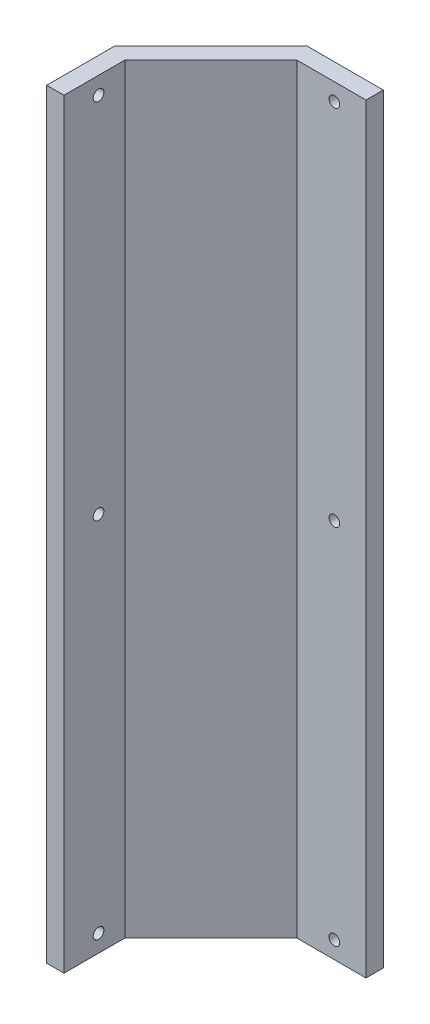
ISO-10303-21;
HEADER;
FILE_DESCRIPTION(('STEP AP214'),'2;1');
FILE_NAME('part.step','',(''),(''),'','','');
FILE_SCHEMA(('AUTOMOTIVE_DESIGN { 1 0 10303 214 1 1 1 1 }'));
ENDSEC;
DATA;
#1=APPLICATION_CONTEXT('core data for automotive mechanical design processes');
#2=APPLICATION_PROTOCOL_DEFINITION('international standard','automotive_design',2000,#1);
#3=PRODUCT_CONTEXT('',#1,'mechanical');
#4=PRODUCT('Part','Part','',(#3));
#5=PRODUCT_RELATED_PRODUCT_CATEGORY('part','',(#4));
#6=PRODUCT_DEFINITION_FORMATION('','',#4);
#7=PRODUCT_DEFINITION_CONTEXT('part definition',#1,'design');
#8=PRODUCT_DEFINITION('design','',#6,#7);
#9=PRODUCT_DEFINITION_SHAPE('','',#8);
#10=(LENGTH_UNIT() NAMED_UNIT(*) SI_UNIT(.MILLI.,.METRE.));
#11=(NAMED_UNIT(*) PLANE_ANGLE_UNIT() SI_UNIT($,.RADIAN.));
#12=(NAMED_UNIT(*) SI_UNIT($,.STERADIAN.) SOLID_ANGLE_UNIT());
#13=UNCERTAINTY_MEASURE_WITH_UNIT(LENGTH_MEASURE(1.E-05),#10,'distance_accuracy_value','');
#14=(GEOMETRIC_REPRESENTATION_CONTEXT(3) GLOBAL_UNCERTAINTY_ASSIGNED_CONTEXT((#13)) GLOBAL_UNIT_ASSIGNED_CONTEXT((#10,
#11,#12)) REPRESENTATION_CONTEXT('',''));
#15=CARTESIAN_POINT('',(0.,0.,0.));
#16=DIRECTION('',(0.,0.,1.));
#17=DIRECTION('',(1.,0.,0.));
#18=AXIS2_PLACEMENT_3D('',#15,#16,#17);
#19=CARTESIAN_POINT('',(-67.5233267740288,220.,-42.5));
#20=DIRECTION('',(0.,0.,-1.));
#21=DIRECTION('',(-1.,0.,0.));
#22=AXIS2_PLACEMENT_3D('',#19,#20,#21);
#23=PLANE('',#22);
#24=CARTESIAN_POINT('',(-76.6933267740289,5.,-42.5));
#25=DIRECTION('',(0.,0.,-1.));
#26=DIRECTION('',(-1.,0.,0.));
#27=AXIS2_PLACEMENT_3D('',#24,#25,#26);
#28=CIRCLE('',#27,1.54999999999999);
#29=CARTESIAN_POINT('',(-78.2433267740289,5.,-42.5));
#30=VERTEX_POINT('',#29);
#31=EDGE_CURVE('E215',#30,#30,#28,.F.);
#32=ORIENTED_EDGE('',*,*,#31,.F.);
#33=EDGE_LOOP('',(#32));
#34=FACE_BOUND('',#33,.T.);
#35=DIRECTION('',(1.,0.,0.));
#36=VECTOR('',#35,1.);
#37=CARTESIAN_POINT('',(-67.5233267740288,0.,-42.5));
#38=LINE('',#37,#36);
#39=CARTESIAN_POINT('',(-87.5233267740289,0.,-42.5));
#40=VERTEX_POINT('',#39);
#41=CARTESIAN_POINT('',(-67.5233267740288,0.,-42.5));
#42=VERTEX_POINT('',#41);
#43=EDGE_CURVE('E143',#40,#42,#38,.T.);
#44=ORIENTED_EDGE('',*,*,#43,.T.);
#45=DIRECTION('',(0.,-1.,0.));
#46=VECTOR('',#45,1.);
#47=CARTESIAN_POINT('',(-67.5233267740288,220.,-42.5));
#48=LINE('',#47,#46);
#49=CARTESIAN_POINT('',(-67.5233267740288,220.,-42.5));
#50=VERTEX_POINT('',#49);
#51=EDGE_CURVE('E11',#50,#42,#48,.T.);
#52=ORIENTED_EDGE('',*,*,#51,.F.);
#53=DIRECTION('',(1.,0.,0.));
#54=VECTOR('',#53,1.);
#55=CARTESIAN_POINT('',(-67.5233267740288,220.,-42.5));
#56=LINE('',#55,#54);
#57=CARTESIAN_POINT('',(-87.5233267740289,220.,-42.5));
#58=VERTEX_POINT('',#57);
#59=EDGE_CURVE('E166',#58,#50,#56,.T.);
#60=ORIENTED_EDGE('',*,*,#59,.F.);
#61=DIRECTION('',(0.,-1.,0.));
#62=VECTOR('',#61,1.);
#63=CARTESIAN_POINT('',(-87.5233267740289,220.,-42.5));
#64=LINE('',#63,#62);
#65=EDGE_CURVE('E139',#58,#40,#64,.T.);
#66=ORIENTED_EDGE('',*,*,#65,.T.);
#67=EDGE_LOOP('',(#44,#52,#60,#66));
#68=FACE_BOUND('',#67,.T.);
#69=CARTESIAN_POINT('',(-76.6933267740289,110.,-42.5));
#70=DIRECTION('',(0.,0.,-1.));
#71=DIRECTION('',(-1.,0.,0.));
#72=AXIS2_PLACEMENT_3D('',#69,#70,#71);
#73=CIRCLE('',#72,1.54999999999999);
#74=CARTESIAN_POINT('',(-78.2433267740289,110.,-42.5));
#75=VERTEX_POINT('',#74);
#76=EDGE_CURVE('E199',#75,#75,#73,.F.);
#77=ORIENTED_EDGE('',*,*,#76,.F.);
#78=EDGE_LOOP('',(#77));
#79=FACE_BOUND('',#78,.T.);
#80=CARTESIAN_POINT('',(-76.6933267740289,215.,-42.5));
#81=DIRECTION('',(0.,0.,-1.));
#82=DIRECTION('',(-1.,0.,0.));
#83=AXIS2_PLACEMENT_3D('',#80,#81,#82);
#84=CIRCLE('',#83,1.54999999999999);
#85=CARTESIAN_POINT('',(-78.2433267740289,215.,-42.5));
#86=VERTEX_POINT('',#85);
#87=EDGE_CURVE('E203',#86,#86,#84,.T.);
#88=ORIENTED_EDGE('',*,*,#87,.T.);
#89=EDGE_LOOP('',(#88));
#90=FACE_BOUND('',#89,.T.);
#91=ADVANCED_FACE('F39',(#34,#68,#79,#90),#23,.F.);
#92=CARTESIAN_POINT('',(-67.5233267740289,220.,-47.5));
#93=DIRECTION('',(0.,0.,1.));
#94=DIRECTION('',(1.,0.,0.));
#95=AXIS2_PLACEMENT_3D('',#92,#93,#94);
#96=PLANE('',#95);
#97=CARTESIAN_POINT('',(-76.6933267740289,5.,-47.5));
#98=DIRECTION('',(0.,0.,1.));
#99=DIRECTION('',(1.,0.,0.));
#100=AXIS2_PLACEMENT_3D('',#97,#98,#99);
#101=CIRCLE('',#100,1.54999999999999);
#102=CARTESIAN_POINT('',(-75.1433267740289,5.,-47.5));
#103=VERTEX_POINT('',#102);
#104=EDGE_CURVE('E42',#103,#103,#101,.F.);
#105=ORIENTED_EDGE('',*,*,#104,.F.);
#106=EDGE_LOOP('',(#105));
#107=FACE_BOUND('',#106,.T.);
#108=DIRECTION('',(-1.,0.,0.));
#109=VECTOR('',#108,1.);
#110=CARTESIAN_POINT('',(-67.5233267740289,0.,-47.5));
#111=LINE('',#110,#109);
#112=CARTESIAN_POINT('',(-67.5233267740289,0.,-47.5));
#113=VERTEX_POINT('',#112);
#114=CARTESIAN_POINT('',(-89.5943945858943,0.,-47.5));
#115=VERTEX_POINT('',#114);
#116=EDGE_CURVE('E151',#113,#115,#111,.T.);
#117=ORIENTED_EDGE('',*,*,#116,.T.);
#118=DIRECTION('',(0.,-1.,0.));
#119=VECTOR('',#118,1.);
#120=CARTESIAN_POINT('',(-89.5943945858943,220.,-47.5));
#121=LINE('',#120,#119);
#122=CARTESIAN_POINT('',(-89.5943945858943,220.,-47.5));
#123=VERTEX_POINT('',#122);
#124=EDGE_CURVE('E177',#123,#115,#121,.T.);
#125=ORIENTED_EDGE('',*,*,#124,.F.);
#126=DIRECTION('',(-1.,0.,0.));
#127=VECTOR('',#126,1.);
#128=CARTESIAN_POINT('',(-67.5233267740289,220.,-47.5));
#129=LINE('',#128,#127);
#130=CARTESIAN_POINT('',(-67.5233267740289,220.,-47.5));
#131=VERTEX_POINT('',#130);
#132=EDGE_CURVE('E234',#131,#123,#129,.T.);
#133=ORIENTED_EDGE('',*,*,#132,.F.);
#134=DIRECTION('',(0.,-1.,0.));
#135=VECTOR('',#134,1.);
#136=CARTESIAN_POINT('',(-67.5233267740289,220.,-47.5));
#137=LINE('',#136,#135);
#138=EDGE_CURVE('E49',#131,#113,#137,.T.);
#139=ORIENTED_EDGE('',*,*,#138,.T.);
#140=EDGE_LOOP('',(#117,#125,#133,#139));
#141=FACE_BOUND('',#140,.T.);
#142=CARTESIAN_POINT('',(-76.6933267740289,110.,-47.5));
#143=DIRECTION('',(0.,0.,1.));
#144=DIRECTION('',(1.,0.,0.));
#145=AXIS2_PLACEMENT_3D('',#142,#143,#144);
#146=CIRCLE('',#145,1.54999999999999);
#147=CARTESIAN_POINT('',(-75.1433267740289,110.,-47.5));
#148=VERTEX_POINT('',#147);
#149=EDGE_CURVE('E196',#148,#148,#146,.F.);
#150=ORIENTED_EDGE('',*,*,#149,.F.);
#151=EDGE_LOOP('',(#150));
#152=FACE_BOUND('',#151,.T.);
#153=CARTESIAN_POINT('',(-76.6933267740289,215.,-47.5));
#154=DIRECTION('',(0.,0.,1.));
#155=DIRECTION('',(1.,0.,0.));
#156=AXIS2_PLACEMENT_3D('',#153,#154,#155);
#157=CIRCLE('',#156,1.54999999999999);
#158=CARTESIAN_POINT('',(-75.1433267740289,215.,-47.5));
#159=VERTEX_POINT('',#158);
#160=EDGE_CURVE('E200',#159,#159,#157,.T.);
#161=ORIENTED_EDGE('',*,*,#160,.T.);
#162=EDGE_LOOP('',(#161));
#163=FACE_BOUND('',#162,.T.);
#164=ADVANCED_FACE('F247',(#107,#141,#152,#163),#96,.F.);
#165=CARTESIAN_POINT('',(-117.419250373172,220.,-19.675144212722));
#166=DIRECTION('',(1.,0.,0.));
#167=DIRECTION('',(0.,0.,-1.));
#168=AXIS2_PLACEMENT_3D('',#165,#166,#167);
#169=PLANE('',#168);
#170=CARTESIAN_POINT('',(-117.419250373172,110.,-10.));
#171=DIRECTION('',(-1.,0.,0.));
#172=DIRECTION('',(0.,0.,1.));
#173=AXIS2_PLACEMENT_3D('',#170,#171,#172);
#174=CIRCLE('',#173,1.55);
#175=CARTESIAN_POINT('',(-117.419250373172,110.,-8.45));
#176=VERTEX_POINT('',#175);
#177=EDGE_CURVE('E223',#176,#176,#174,.T.);
#178=ORIENTED_EDGE('',*,*,#177,.F.);
#179=EDGE_LOOP('',(#178));
#180=FACE_BOUND('',#179,.T.);
#181=CARTESIAN_POINT('',(-117.419250373172,4.99999999999993,-10.));
#182=DIRECTION('',(-1.,0.,0.));
#183=DIRECTION('',(0.,0.,1.));
#184=AXIS2_PLACEMENT_3D('',#181,#182,#183);
#185=CIRCLE('',#184,1.55);
#186=CARTESIAN_POINT('',(-117.419250373172,4.99999999999993,-8.45000000000003));
#187=VERTEX_POINT('',#186);
#188=EDGE_CURVE('E219',#187,#187,#185,.F.);
#189=ORIENTED_EDGE('',*,*,#188,.T.);
#190=EDGE_LOOP('',(#189));
#191=FACE_BOUND('',#190,.T.);
#192=DIRECTION('',(0.,0.,1.));
#193=VECTOR('',#192,1.);
#194=CARTESIAN_POINT('',(-117.419250373172,0.,-19.675144212722));
#195=LINE('',#194,#193);
#196=CARTESIAN_POINT('',(-117.419250373172,0.,-19.675144212722));
#197=VERTEX_POINT('',#196);
#198=CARTESIAN_POINT('',(-117.419250373172,0.,0.));
#199=VERTEX_POINT('',#198);
#200=EDGE_CURVE('E157',#197,#199,#195,.T.);
#201=ORIENTED_EDGE('',*,*,#200,.T.);
#202=DIRECTION('',(0.,-1.,0.));
#203=VECTOR('',#202,1.);
#204=CARTESIAN_POINT('',(-117.419250373172,220.,0.));
#205=LINE('',#204,#203);
#206=CARTESIAN_POINT('',(-117.419250373172,220.,0.));
#207=VERTEX_POINT('',#206);
#208=EDGE_CURVE('E131',#207,#199,#205,.T.);
#209=ORIENTED_EDGE('',*,*,#208,.F.);
#210=DIRECTION('',(0.,0.,1.));
#211=VECTOR('',#210,1.);
#212=CARTESIAN_POINT('',(-117.419250373172,220.,-19.675144212722));
#213=LINE('',#212,#211);
#214=CARTESIAN_POINT('',(-117.419250373172,220.,-19.675144212722));
#215=VERTEX_POINT('',#214);
#216=EDGE_CURVE('E120',#215,#207,#213,.T.);
#217=ORIENTED_EDGE('',*,*,#216,.F.);
#218=DIRECTION('',(0.,-1.,0.));
#219=VECTOR('',#218,1.);
#220=CARTESIAN_POINT('',(-117.419250373172,220.,-19.675144212722));
#221=LINE('',#220,#219);
#222=EDGE_CURVE('E173',#215,#197,#221,.T.);
#223=ORIENTED_EDGE('',*,*,#222,.T.);
#224=EDGE_LOOP('',(#201,#209,#217,#223));
#225=FACE_BOUND('',#224,.T.);
#226=CARTESIAN_POINT('',(-117.419250373172,215.,-10.));
#227=DIRECTION('',(-1.,0.,0.));
#228=DIRECTION('',(0.,0.,1.));
#229=AXIS2_PLACEMENT_3D('',#226,#227,#228);
#230=CIRCLE('',#229,1.55);
#231=CARTESIAN_POINT('',(-117.419250373172,215.,-8.45000000000004));
#232=VERTEX_POINT('',#231);
#233=EDGE_CURVE('E189',#232,#232,#230,.T.);
#234=ORIENTED_EDGE('',*,*,#233,.F.);
#235=EDGE_LOOP('',(#234));
#236=FACE_BOUND('',#235,.T.);
#237=ADVANCED_FACE('F250',(#180,#191,#225,#236),#169,.F.);
#238=CARTESIAN_POINT('',(-112.419250373172,220.,-17.6040764008565));
#239=DIRECTION('',(-1.,0.,0.));
#240=DIRECTION('',(0.,0.,1.));
#241=AXIS2_PLACEMENT_3D('',#238,#239,#240);
#242=PLANE('',#241);
#243=CARTESIAN_POINT('',(-112.419250373172,110.,-10.));
#244=DIRECTION('',(-1.,0.,0.));
#245=DIRECTION('',(0.,0.,1.));
#246=AXIS2_PLACEMENT_3D('',#243,#244,#245);
#247=CIRCLE('',#246,1.55);
#248=CARTESIAN_POINT('',(-112.419250373172,110.,-8.45));
#249=VERTEX_POINT('',#248);
#250=EDGE_CURVE('E188',#249,#249,#247,.T.);
#251=ORIENTED_EDGE('',*,*,#250,.T.);
#252=EDGE_LOOP('',(#251));
#253=FACE_BOUND('',#252,.T.);
#254=CARTESIAN_POINT('',(-112.419250373172,4.99999999999993,-10.));
#255=DIRECTION('',(-1.,0.,0.));
#256=DIRECTION('',(0.,0.,1.));
#257=AXIS2_PLACEMENT_3D('',#254,#255,#256);
#258=CIRCLE('',#257,1.55);
#259=CARTESIAN_POINT('',(-112.419250373172,4.99999999999993,-8.45000000000004));
#260=VERTEX_POINT('',#259);
#261=EDGE_CURVE('E184',#260,#260,#258,.F.);
#262=ORIENTED_EDGE('',*,*,#261,.F.);
#263=EDGE_LOOP('',(#262));
#264=FACE_BOUND('',#263,.T.);
#265=DIRECTION('',(0.,0.,-1.));
#266=VECTOR('',#265,1.);
#267=CARTESIAN_POINT('',(-112.419250373172,0.,-17.6040764008565));
#268=LINE('',#267,#266);
#269=CARTESIAN_POINT('',(-112.419250373172,0.,0.));
#270=VERTEX_POINT('',#269);
#271=CARTESIAN_POINT('',(-112.419250373172,0.,-17.6040764008565));
#272=VERTEX_POINT('',#271);
#273=EDGE_CURVE('E87',#270,#272,#268,.T.);
#274=ORIENTED_EDGE('',*,*,#273,.T.);
#275=DIRECTION('',(0.,-1.,0.));
#276=VECTOR('',#275,1.);
#277=CARTESIAN_POINT('',(-112.419250373172,220.,-17.6040764008565));
#278=LINE('',#277,#276);
#279=CARTESIAN_POINT('',(-112.419250373172,220.,-17.6040764008565));
#280=VERTEX_POINT('',#279);
#281=EDGE_CURVE('E132',#280,#272,#278,.T.);
#282=ORIENTED_EDGE('',*,*,#281,.F.);
#283=DIRECTION('',(0.,0.,-1.));
#284=VECTOR('',#283,1.);
#285=CARTESIAN_POINT('',(-112.419250373172,220.,-17.6040764008565));
#286=LINE('',#285,#284);
#287=CARTESIAN_POINT('',(-112.419250373172,220.,0.));
#288=VERTEX_POINT('',#287);
#289=EDGE_CURVE('E118',#288,#280,#286,.T.);
#290=ORIENTED_EDGE('',*,*,#289,.F.);
#291=DIRECTION('',(0.,-1.,0.));
#292=VECTOR('',#291,1.);
#293=CARTESIAN_POINT('',(-112.419250373172,220.,0.));
#294=LINE('',#293,#292);
#295=EDGE_CURVE('E126',#288,#270,#294,.T.);
#296=ORIENTED_EDGE('',*,*,#295,.T.);
#297=EDGE_LOOP('',(#274,#282,#290,#296));
#298=FACE_BOUND('',#297,.T.);
#299=CARTESIAN_POINT('',(-112.419250373172,215.,-10.));
#300=DIRECTION('',(-1.,0.,0.));
#301=DIRECTION('',(0.,0.,1.));
#302=AXIS2_PLACEMENT_3D('',#299,#300,#301);
#303=CIRCLE('',#302,1.55);
#304=CARTESIAN_POINT('',(-112.419250373172,215.,-8.45000000000004));
#305=VERTEX_POINT('',#304);
#306=EDGE_CURVE('E148',#305,#305,#303,.T.);
#307=ORIENTED_EDGE('',*,*,#306,.T.);
#308=EDGE_LOOP('',(#307));
#309=FACE_BOUND('',#308,.T.);
#310=ADVANCED_FACE('F134',(#253,#264,#298,#309),#242,.F.);
#311=CARTESIAN_POINT('',(-67.5233267740288,220.,-42.5));
#312=DIRECTION('',(-1.,0.,0.));
#313=DIRECTION('',(0.,0.,1.));
#314=AXIS2_PLACEMENT_3D('',#311,#312,#313);
#315=PLANE('',#314);
#316=DIRECTION('',(0.,0.,-1.));
#317=VECTOR('',#316,1.);
#318=CARTESIAN_POINT('',(-67.5233267740288,0.,-42.5));
#319=LINE('',#318,#317);
#320=EDGE_CURVE('E147',#42,#113,#319,.T.);
#321=ORIENTED_EDGE('',*,*,#320,.T.);
#322=ORIENTED_EDGE('',*,*,#138,.F.);
#323=DIRECTION('',(0.,0.,-1.));
#324=VECTOR('',#323,1.);
#325=CARTESIAN_POINT('',(-67.5233267740288,220.,-42.5));
#326=LINE('',#325,#324);
#327=EDGE_CURVE('E101',#50,#131,#326,.T.);
#328=ORIENTED_EDGE('',*,*,#327,.F.);
#329=ORIENTED_EDGE('',*,*,#51,.T.);
#330=EDGE_LOOP('',(#321,#322,#328,#329));
#331=FACE_BOUND('',#330,.T.);
#332=ADVANCED_FACE('F287',(#331),#315,.F.);
#333=CARTESIAN_POINT('',(-89.5943945858943,220.,-47.5));
#334=DIRECTION('',(0.707106781186548,0.,0.707106781186547));
#335=DIRECTION('',(0.707106781186547,0.,-0.707106781186548));
#336=AXIS2_PLACEMENT_3D('',#333,#334,#335);
#337=PLANE('',#336);
#338=DIRECTION('',(-0.707106781186547,0.,0.707106781186548));
#339=VECTOR('',#338,1.);
#340=CARTESIAN_POINT('',(-89.5943945858943,0.,-47.5));
#341=LINE('',#340,#339);
#342=EDGE_CURVE('E154',#115,#197,#341,.T.);
#343=ORIENTED_EDGE('',*,*,#342,.T.);
#344=ORIENTED_EDGE('',*,*,#222,.F.);
#345=DIRECTION('',(-0.707106781186547,0.,0.707106781186548));
#346=VECTOR('',#345,1.);
#347=CARTESIAN_POINT('',(-89.5943945858943,220.,-47.5));
#348=LINE('',#347,#346);
#349=EDGE_CURVE('E237',#123,#215,#348,.T.);
#350=ORIENTED_EDGE('',*,*,#349,.F.);
#351=ORIENTED_EDGE('',*,*,#124,.T.);
#352=EDGE_LOOP('',(#343,#344,#350,#351));
#353=FACE_BOUND('',#352,.T.);
#354=ADVANCED_FACE('F289',(#353),#337,.F.);
#355=CARTESIAN_POINT('',(-112.419250373172,220.,0.));
#356=DIRECTION('',(0.,0.,-1.));
#357=DIRECTION('',(-1.,0.,0.));
#358=AXIS2_PLACEMENT_3D('',#355,#356,#357);
#359=PLANE('',#358);
#360=DIRECTION('',(1.,0.,0.));
#361=VECTOR('',#360,1.);
#362=CARTESIAN_POINT('',(-112.419250373172,0.,0.));
#363=LINE('',#362,#361);
#364=EDGE_CURVE('E129',#199,#270,#363,.T.);
#365=ORIENTED_EDGE('',*,*,#364,.T.);
#366=ORIENTED_EDGE('',*,*,#295,.F.);
#367=DIRECTION('',(1.,0.,0.));
#368=VECTOR('',#367,1.);
#369=CARTESIAN_POINT('',(-112.419250373172,220.,0.));
#370=LINE('',#369,#368);
#371=EDGE_CURVE('E114',#207,#288,#370,.T.);
#372=ORIENTED_EDGE('',*,*,#371,.F.);
#373=ORIENTED_EDGE('',*,*,#208,.T.);
#374=EDGE_LOOP('',(#365,#366,#372,#373));
#375=FACE_BOUND('',#374,.T.);
#376=ADVANCED_FACE('F127',(#375),#359,.F.);
#377=CARTESIAN_POINT('',(-87.5233267740289,220.,-42.5));
#378=DIRECTION('',(-0.707106781186548,0.,-0.707106781186547));
#379=DIRECTION('',(-0.707106781186547,0.,0.707106781186548));
#380=AXIS2_PLACEMENT_3D('',#377,#378,#379);
#381=PLANE('',#380);
#382=DIRECTION('',(0.707106781186547,0.,-0.707106781186548));
#383=VECTOR('',#382,1.);
#384=CARTESIAN_POINT('',(-87.5233267740289,0.,-42.5));
#385=LINE('',#384,#383);
#386=EDGE_CURVE('E93',#272,#40,#385,.T.);
#387=ORIENTED_EDGE('',*,*,#386,.T.);
#388=ORIENTED_EDGE('',*,*,#65,.F.);
#389=DIRECTION('',(0.707106781186547,0.,-0.707106781186548));
#390=VECTOR('',#389,1.);
#391=CARTESIAN_POINT('',(-87.5233267740289,220.,-42.5));
#392=LINE('',#391,#390);
#393=EDGE_CURVE('E58',#280,#58,#392,.T.);
#394=ORIENTED_EDGE('',*,*,#393,.F.);
#395=ORIENTED_EDGE('',*,*,#281,.T.);
#396=EDGE_LOOP('',(#387,#388,#394,#395));
#397=FACE_BOUND('',#396,.T.);
#398=ADVANCED_FACE('F303',(#397),#381,.F.);
#399=CARTESIAN_POINT('',(0.,220.,0.));
#400=DIRECTION('',(0.,1.,0.));
#401=DIRECTION('',(0.,0.,1.));
#402=AXIS2_PLACEMENT_3D('',#399,#400,#401);
#403=PLANE('',#402);
#404=ORIENTED_EDGE('',*,*,#59,.T.);
#405=ORIENTED_EDGE('',*,*,#327,.T.);
#406=ORIENTED_EDGE('',*,*,#132,.T.);
#407=ORIENTED_EDGE('',*,*,#349,.T.);
#408=ORIENTED_EDGE('',*,*,#216,.T.);
#409=ORIENTED_EDGE('',*,*,#371,.T.);
#410=ORIENTED_EDGE('',*,*,#289,.T.);
#411=ORIENTED_EDGE('',*,*,#393,.T.);
#412=EDGE_LOOP('',(#404,#405,#406,#407,#408,#409,#410,#411));
#413=FACE_BOUND('',#412,.T.);
#414=ADVANCED_FACE('F116',(#413),#403,.T.);
#415=CARTESIAN_POINT('',(0.,0.,0.));
#416=DIRECTION('',(0.,1.,0.));
#417=DIRECTION('',(0.,0.,1.));
#418=AXIS2_PLACEMENT_3D('',#415,#416,#417);
#419=PLANE('',#418);
#420=ORIENTED_EDGE('',*,*,#43,.F.);
#421=ORIENTED_EDGE('',*,*,#386,.F.);
#422=ORIENTED_EDGE('',*,*,#273,.F.);
#423=ORIENTED_EDGE('',*,*,#364,.F.);
#424=ORIENTED_EDGE('',*,*,#200,.F.);
#425=ORIENTED_EDGE('',*,*,#342,.F.);
#426=ORIENTED_EDGE('',*,*,#116,.F.);
#427=ORIENTED_EDGE('',*,*,#320,.F.);
#428=EDGE_LOOP('',(#420,#421,#422,#423,#424,#425,#426,#427));
#429=FACE_BOUND('',#428,.T.);
#430=ADVANCED_FACE('F285',(#429),#419,.F.);
#431=CARTESIAN_POINT('',(-107.419250373172,4.99999999999993,-10.));
#432=DIRECTION('',(-1.,0.,0.));
#433=DIRECTION('',(0.,0.,1.));
#434=AXIS2_PLACEMENT_3D('',#431,#432,#433);
#435=CYLINDRICAL_SURFACE('',#434,1.55);
#436=ORIENTED_EDGE('',*,*,#188,.F.);
#437=EDGE_LOOP('',(#436));
#438=FACE_BOUND('',#437,.T.);
#439=ORIENTED_EDGE('',*,*,#261,.T.);
#440=EDGE_LOOP('',(#439));
#441=FACE_BOUND('',#440,.T.);
#442=ADVANCED_FACE('F309',(#438,#441),#435,.F.);
#443=CARTESIAN_POINT('',(-107.419250373172,110.,-10.));
#444=DIRECTION('',(-1.,0.,0.));
#445=DIRECTION('',(0.,0.,1.));
#446=AXIS2_PLACEMENT_3D('',#443,#444,#445);
#447=CYLINDRICAL_SURFACE('',#446,1.55);
#448=ORIENTED_EDGE('',*,*,#177,.T.);
#449=EDGE_LOOP('',(#448));
#450=FACE_BOUND('',#449,.T.);
#451=ORIENTED_EDGE('',*,*,#250,.F.);
#452=EDGE_LOOP('',(#451));
#453=FACE_BOUND('',#452,.T.);
#454=ADVANCED_FACE('F268',(#450,#453),#447,.F.);
#455=CARTESIAN_POINT('',(-107.419250373172,215.,-10.));
#456=DIRECTION('',(-1.,0.,0.));
#457=DIRECTION('',(0.,0.,1.));
#458=AXIS2_PLACEMENT_3D('',#455,#456,#457);
#459=CYLINDRICAL_SURFACE('',#458,1.55);
#460=ORIENTED_EDGE('',*,*,#233,.T.);
#461=EDGE_LOOP('',(#460));
#462=FACE_BOUND('',#461,.T.);
#463=ORIENTED_EDGE('',*,*,#306,.F.);
#464=EDGE_LOOP('',(#463));
#465=FACE_BOUND('',#464,.T.);
#466=ADVANCED_FACE('F260',(#462,#465),#459,.F.);
#467=CARTESIAN_POINT('',(-76.6933267740289,110.,77.5));
#468=DIRECTION('',(0.,0.,-1.));
#469=DIRECTION('',(-1.,0.,0.));
#470=AXIS2_PLACEMENT_3D('',#467,#468,#469);
#471=CYLINDRICAL_SURFACE('',#470,1.54999999999999);
#472=ORIENTED_EDGE('',*,*,#149,.T.);
#473=EDGE_LOOP('',(#472));
#474=FACE_BOUND('',#473,.T.);
#475=ORIENTED_EDGE('',*,*,#76,.T.);
#476=EDGE_LOOP('',(#475));
#477=FACE_BOUND('',#476,.T.);
#478=ADVANCED_FACE('F257',(#474,#477),#471,.F.);
#479=CARTESIAN_POINT('',(-76.6933267740289,215.,77.5));
#480=DIRECTION('',(0.,0.,-1.));
#481=DIRECTION('',(-1.,0.,0.));
#482=AXIS2_PLACEMENT_3D('',#479,#480,#481);
#483=CYLINDRICAL_SURFACE('',#482,1.54999999999999);
#484=ORIENTED_EDGE('',*,*,#160,.F.);
#485=EDGE_LOOP('',(#484));
#486=FACE_BOUND('',#485,.T.);
#487=ORIENTED_EDGE('',*,*,#87,.F.);
#488=EDGE_LOOP('',(#487));
#489=FACE_BOUND('',#488,.T.);
#490=ADVANCED_FACE('F259',(#486,#489),#483,.F.);
#491=CARTESIAN_POINT('',(-76.6933267740289,5.,77.5));
#492=DIRECTION('',(0.,0.,-1.));
#493=DIRECTION('',(-1.,0.,0.));
#494=AXIS2_PLACEMENT_3D('',#491,#492,#493);
#495=CYLINDRICAL_SURFACE('',#494,1.54999999999999);
#496=ORIENTED_EDGE('',*,*,#104,.T.);
#497=EDGE_LOOP('',(#496));
#498=FACE_BOUND('',#497,.T.);
#499=ORIENTED_EDGE('',*,*,#31,.T.);
#500=EDGE_LOOP('',(#499));
#501=FACE_BOUND('',#500,.T.);
#502=ADVANCED_FACE('F244',(#498,#501),#495,.F.);
#503=CLOSED_SHELL('',(#91,#164,#237,#310,#332,#354,#376,#398,#414,#430,#442,#454,#466,#478,#490,#502));
#504=MANIFOLD_SOLID_BREP('B2',#503);
#505=ADVANCED_BREP_SHAPE_REPRESENTATION('',(#18,#504),#14);
#506=SHAPE_DEFINITION_REPRESENTATION(#9,#505);
ENDSEC;
END-ISO-10303-21;
